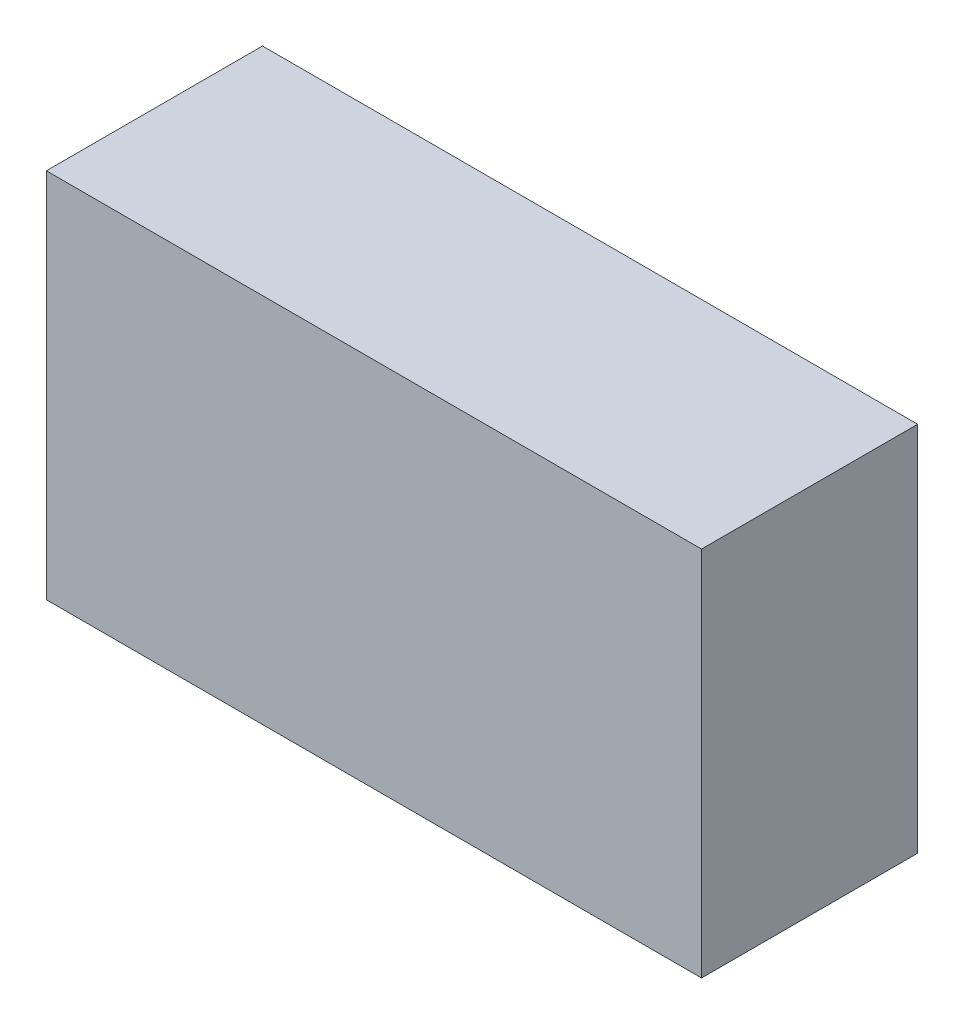
ISO-10303-21;
HEADER;
FILE_DESCRIPTION(('STEP AP214'),'2;1');
FILE_NAME('part.step','',(''),(''),'','','');
FILE_SCHEMA(('AUTOMOTIVE_DESIGN { 1 0 10303 214 1 1 1 1 }'));
ENDSEC;
DATA;
#1=APPLICATION_CONTEXT('core data for automotive mechanical design processes');
#2=APPLICATION_PROTOCOL_DEFINITION('international standard','automotive_design',2000,#1);
#3=PRODUCT_CONTEXT('',#1,'mechanical');
#4=PRODUCT('Part','Part','',(#3));
#5=PRODUCT_RELATED_PRODUCT_CATEGORY('part','',(#4));
#6=PRODUCT_DEFINITION_FORMATION('','',#4);
#7=PRODUCT_DEFINITION_CONTEXT('part definition',#1,'design');
#8=PRODUCT_DEFINITION('design','',#6,#7);
#9=PRODUCT_DEFINITION_SHAPE('','',#8);
#10=(LENGTH_UNIT() NAMED_UNIT(*) SI_UNIT(.MILLI.,.METRE.));
#11=(NAMED_UNIT(*) PLANE_ANGLE_UNIT() SI_UNIT($,.RADIAN.));
#12=(NAMED_UNIT(*) SI_UNIT($,.STERADIAN.) SOLID_ANGLE_UNIT());
#13=UNCERTAINTY_MEASURE_WITH_UNIT(LENGTH_MEASURE(1.E-05),#10,'distance_accuracy_value','');
#14=(GEOMETRIC_REPRESENTATION_CONTEXT(3) GLOBAL_UNCERTAINTY_ASSIGNED_CONTEXT((#13)) GLOBAL_UNIT_ASSIGNED_CONTEXT((#10,
#11,#12)) REPRESENTATION_CONTEXT('',''));
#15=CARTESIAN_POINT('',(0.,0.,0.));
#16=DIRECTION('',(0.,0.,1.));
#17=DIRECTION('',(1.,0.,0.));
#18=AXIS2_PLACEMENT_3D('',#15,#16,#17);
#19=CARTESIAN_POINT('',(0.04,0.,0.04));
#20=DIRECTION('',(1.,0.,0.));
#21=DIRECTION('',(0.,0.,1.));
#22=AXIS2_PLACEMENT_3D('',#19,#20,#21);
#23=PLANE('',#22);
#24=DIRECTION('',(0.,1.,0.));
#25=VECTOR('',#24,1.);
#26=CARTESIAN_POINT('',(0.04,0.,0.36));
#27=LINE('',#26,#25);
#28=CARTESIAN_POINT('',(0.04,0.,0.36));
#29=VERTEX_POINT('',#28);
#30=CARTESIAN_POINT('',(0.04,0.55,0.36));
#31=VERTEX_POINT('',#30);
#32=EDGE_CURVE('E11',#29,#31,#27,.T.);
#33=ORIENTED_EDGE('',*,*,#32,.T.);
#34=DIRECTION('',(0.,0.,1.));
#35=VECTOR('',#34,1.);
#36=CARTESIAN_POINT('',(0.04,0.55,0.04));
#37=LINE('',#36,#35);
#38=CARTESIAN_POINT('',(0.04,0.55,0.04));
#39=VERTEX_POINT('',#38);
#40=EDGE_CURVE('E24',#39,#31,#37,.T.);
#41=ORIENTED_EDGE('',*,*,#40,.F.);
#42=DIRECTION('',(0.,1.,0.));
#43=VECTOR('',#42,1.);
#44=CARTESIAN_POINT('',(0.04,0.,0.04));
#45=LINE('',#44,#43);
#46=CARTESIAN_POINT('',(0.04,0.,0.04));
#47=VERTEX_POINT('',#46);
#48=EDGE_CURVE('E86',#47,#39,#45,.T.);
#49=ORIENTED_EDGE('',*,*,#48,.F.);
#50=DIRECTION('',(0.,0.,1.));
#51=VECTOR('',#50,1.);
#52=CARTESIAN_POINT('',(0.04,0.,0.04));
#53=LINE('',#52,#51);
#54=EDGE_CURVE('E36',#47,#29,#53,.T.);
#55=ORIENTED_EDGE('',*,*,#54,.T.);
#56=EDGE_LOOP('',(#33,#41,#49,#55));
#57=FACE_BOUND('',#56,.T.);
#58=ADVANCED_FACE('F17',(#57),#23,.F.);
#59=CARTESIAN_POINT('',(1.01,0.,0.04));
#60=DIRECTION('',(1.,0.,0.));
#61=DIRECTION('',(0.,0.,1.));
#62=AXIS2_PLACEMENT_3D('',#59,#60,#61);
#63=PLANE('',#62);
#64=DIRECTION('',(0.,0.,1.));
#65=VECTOR('',#64,1.);
#66=CARTESIAN_POINT('',(1.01,0.,0.04));
#67=LINE('',#66,#65);
#68=CARTESIAN_POINT('',(1.01,0.,0.04));
#69=VERTEX_POINT('',#68);
#70=CARTESIAN_POINT('',(1.01,0.,0.36));
#71=VERTEX_POINT('',#70);
#72=EDGE_CURVE('E83',#69,#71,#67,.T.);
#73=ORIENTED_EDGE('',*,*,#72,.F.);
#74=DIRECTION('',(0.,1.,0.));
#75=VECTOR('',#74,1.);
#76=CARTESIAN_POINT('',(1.01,0.,0.04));
#77=LINE('',#76,#75);
#78=CARTESIAN_POINT('',(1.01,0.55,0.04));
#79=VERTEX_POINT('',#78);
#80=EDGE_CURVE('E63',#69,#79,#77,.T.);
#81=ORIENTED_EDGE('',*,*,#80,.T.);
#82=DIRECTION('',(0.,0.,1.));
#83=VECTOR('',#82,1.);
#84=CARTESIAN_POINT('',(1.01,0.55,0.04));
#85=LINE('',#84,#83);
#86=CARTESIAN_POINT('',(1.01,0.55,0.36));
#87=VERTEX_POINT('',#86);
#88=EDGE_CURVE('E57',#79,#87,#85,.T.);
#89=ORIENTED_EDGE('',*,*,#88,.T.);
#90=DIRECTION('',(0.,1.,0.));
#91=VECTOR('',#90,1.);
#92=CARTESIAN_POINT('',(1.01,0.,0.36));
#93=LINE('',#92,#91);
#94=EDGE_CURVE('E60',#71,#87,#93,.T.);
#95=ORIENTED_EDGE('',*,*,#94,.F.);
#96=EDGE_LOOP('',(#73,#81,#89,#95));
#97=FACE_BOUND('',#96,.T.);
#98=ADVANCED_FACE('F59',(#97),#63,.T.);
#99=CARTESIAN_POINT('',(0.04,0.,0.04));
#100=DIRECTION('',(0.,1.,0.));
#101=DIRECTION('',(0.,0.,1.));
#102=AXIS2_PLACEMENT_3D('',#99,#100,#101);
#103=PLANE('',#102);
#104=ORIENTED_EDGE('',*,*,#72,.T.);
#105=DIRECTION('',(1.,0.,0.));
#106=VECTOR('',#105,1.);
#107=CARTESIAN_POINT('',(0.04,0.,0.36));
#108=LINE('',#107,#106);
#109=EDGE_CURVE('E71',#29,#71,#108,.T.);
#110=ORIENTED_EDGE('',*,*,#109,.F.);
#111=ORIENTED_EDGE('',*,*,#54,.F.);
#112=DIRECTION('',(1.,0.,0.));
#113=VECTOR('',#112,1.);
#114=CARTESIAN_POINT('',(0.04,0.,0.04));
#115=LINE('',#114,#113);
#116=EDGE_CURVE('E76',#47,#69,#115,.T.);
#117=ORIENTED_EDGE('',*,*,#116,.T.);
#118=EDGE_LOOP('',(#104,#110,#111,#117));
#119=FACE_BOUND('',#118,.T.);
#120=ADVANCED_FACE('F91',(#119),#103,.F.);
#121=CARTESIAN_POINT('',(0.04,0.55,0.04));
#122=DIRECTION('',(0.,1.,0.));
#123=DIRECTION('',(0.,0.,1.));
#124=AXIS2_PLACEMENT_3D('',#121,#122,#123);
#125=PLANE('',#124);
#126=DIRECTION('',(1.,0.,0.));
#127=VECTOR('',#126,1.);
#128=CARTESIAN_POINT('',(0.04,0.55,0.04));
#129=LINE('',#128,#127);
#130=EDGE_CURVE('E74',#39,#79,#129,.T.);
#131=ORIENTED_EDGE('',*,*,#130,.F.);
#132=ORIENTED_EDGE('',*,*,#40,.T.);
#133=DIRECTION('',(1.,0.,0.));
#134=VECTOR('',#133,1.);
#135=CARTESIAN_POINT('',(0.04,0.55,0.36));
#136=LINE('',#135,#134);
#137=EDGE_CURVE('E69',#31,#87,#136,.T.);
#138=ORIENTED_EDGE('',*,*,#137,.T.);
#139=ORIENTED_EDGE('',*,*,#88,.F.);
#140=EDGE_LOOP('',(#131,#132,#138,#139));
#141=FACE_BOUND('',#140,.T.);
#142=ADVANCED_FACE('F73',(#141),#125,.T.);
#143=CARTESIAN_POINT('',(0.04,0.,0.04));
#144=DIRECTION('',(0.,0.,1.));
#145=DIRECTION('',(1.,0.,0.));
#146=AXIS2_PLACEMENT_3D('',#143,#144,#145);
#147=PLANE('',#146);
#148=ORIENTED_EDGE('',*,*,#130,.T.);
#149=ORIENTED_EDGE('',*,*,#80,.F.);
#150=ORIENTED_EDGE('',*,*,#116,.F.);
#151=ORIENTED_EDGE('',*,*,#48,.T.);
#152=EDGE_LOOP('',(#148,#149,#150,#151));
#153=FACE_BOUND('',#152,.T.);
#154=ADVANCED_FACE('F89',(#153),#147,.F.);
#155=CARTESIAN_POINT('',(0.04,0.,0.36));
#156=DIRECTION('',(0.,0.,1.));
#157=DIRECTION('',(1.,0.,0.));
#158=AXIS2_PLACEMENT_3D('',#155,#156,#157);
#159=PLANE('',#158);
#160=ORIENTED_EDGE('',*,*,#32,.F.);
#161=ORIENTED_EDGE('',*,*,#109,.T.);
#162=ORIENTED_EDGE('',*,*,#94,.T.);
#163=ORIENTED_EDGE('',*,*,#137,.F.);
#164=EDGE_LOOP('',(#160,#161,#162,#163));
#165=FACE_BOUND('',#164,.T.);
#166=ADVANCED_FACE('F68',(#165),#159,.T.);
#167=CLOSED_SHELL('',(#58,#98,#120,#142,#154,#166));
#168=MANIFOLD_SOLID_BREP('B1',#167);
#169=ADVANCED_BREP_SHAPE_REPRESENTATION('',(#18,#168),#14);
#170=SHAPE_DEFINITION_REPRESENTATION(#9,#169);
ENDSEC;
END-ISO-10303-21;
